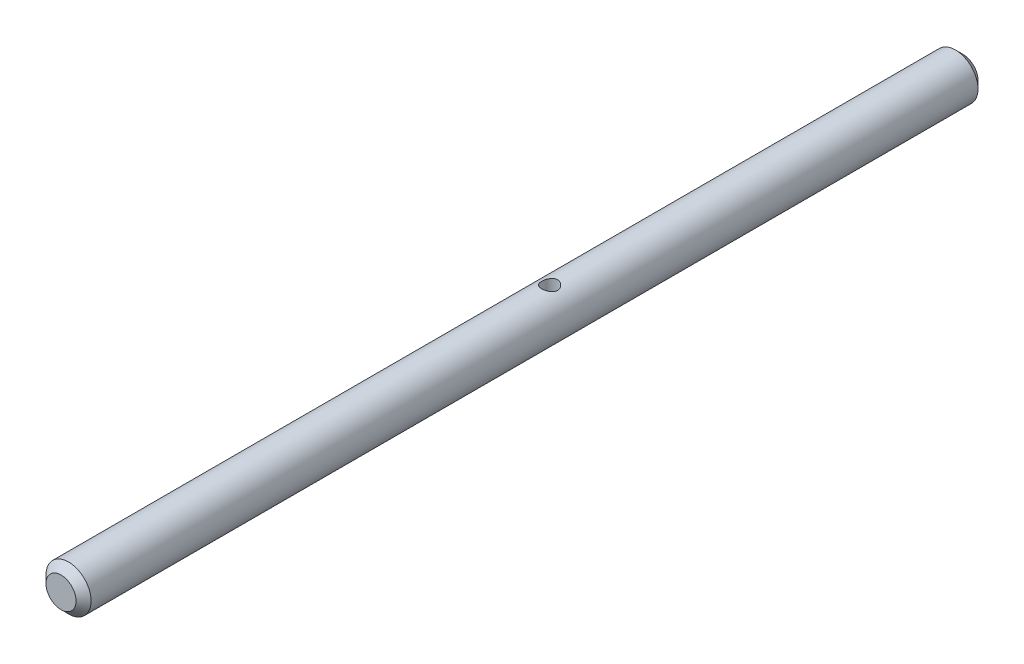
ISO-10303-21;
HEADER;
FILE_DESCRIPTION(('STEP AP214'),'2;1');
FILE_NAME('part.step','',(''),(''),'','','');
FILE_SCHEMA(('AUTOMOTIVE_DESIGN { 1 0 10303 214 1 1 1 1 }'));
ENDSEC;
DATA;
#1=APPLICATION_CONTEXT('core data for automotive mechanical design processes');
#2=APPLICATION_PROTOCOL_DEFINITION('international standard','automotive_design',2000,#1);
#3=PRODUCT_CONTEXT('',#1,'mechanical');
#4=PRODUCT('Part','Part','',(#3));
#5=PRODUCT_RELATED_PRODUCT_CATEGORY('part','',(#4));
#6=PRODUCT_DEFINITION_FORMATION('','',#4);
#7=PRODUCT_DEFINITION_CONTEXT('part definition',#1,'design');
#8=PRODUCT_DEFINITION('design','',#6,#7);
#9=PRODUCT_DEFINITION_SHAPE('','',#8);
#10=(LENGTH_UNIT() NAMED_UNIT(*) SI_UNIT(.MILLI.,.METRE.));
#11=(NAMED_UNIT(*) PLANE_ANGLE_UNIT() SI_UNIT($,.RADIAN.));
#12=(NAMED_UNIT(*) SI_UNIT($,.STERADIAN.) SOLID_ANGLE_UNIT());
#13=UNCERTAINTY_MEASURE_WITH_UNIT(LENGTH_MEASURE(1.E-05),#10,'distance_accuracy_value','');
#14=(GEOMETRIC_REPRESENTATION_CONTEXT(3) GLOBAL_UNCERTAINTY_ASSIGNED_CONTEXT((#13)) GLOBAL_UNIT_ASSIGNED_CONTEXT((#10,
#11,#12)) REPRESENTATION_CONTEXT('',''));
#15=CARTESIAN_POINT('',(0.,0.,0.));
#16=DIRECTION('',(0.,0.,1.));
#17=DIRECTION('',(1.,0.,0.));
#18=AXIS2_PLACEMENT_3D('',#15,#16,#17);
#19=CARTESIAN_POINT('',(0.,0.,65.));
#20=DIRECTION('',(0.,0.,-1.));
#21=DIRECTION('',(-1.,0.,0.));
#22=AXIS2_PLACEMENT_3D('',#19,#20,#21);
#23=CYLINDRICAL_SURFACE('',#22,3.);
#24=CARTESIAN_POINT('',(0.,-3.,1.05));
#25=CARTESIAN_POINT('',(0.057125809700311,-3.00000062239861,1.05000088699482));
#26=CARTESIAN_POINT('',(0.114245286481722,-2.99835359336143,1.04532309857839));
#27=CARTESIAN_POINT('',(0.226792007750672,-2.99194636275058,1.02679986205134));
#28=CARTESIAN_POINT('',(0.28221924468481,-2.98718614728315,1.01295437302645));
#29=CARTESIAN_POINT('',(0.389742706804827,-2.9750673807671,0.97663531844941));
#30=CARTESIAN_POINT('',(0.441844648127425,-2.96771343859195,0.954177051068296));
#31=CARTESIAN_POINT('',(0.541540993588452,-2.95115069919435,0.901342466620792));
#32=CARTESIAN_POINT('',(0.589134369738941,-2.94194148044382,0.87096434966302));
#33=CARTESIAN_POINT('',(0.680257767615976,-2.92224185208095,0.801951445304782));
#34=CARTESIAN_POINT('',(0.723594589428122,-2.91171852533116,0.763071024533266));
#35=CARTESIAN_POINT('',(0.803283555453782,-2.89075018483192,0.678678999315781));
#36=CARTESIAN_POINT('',(0.839633942619032,-2.88030519141591,0.633165731793872));
#37=CARTESIAN_POINT('',(0.905468869308254,-2.86030606263984,0.5350036051324));
#38=CARTESIAN_POINT('',(0.934693899184863,-2.85079156836078,0.482171832462236));
#39=CARTESIAN_POINT('',(0.983759796853539,-2.83423573303673,0.371956622912636));
#40=CARTESIAN_POINT('',(1.00360386635585,-2.82719354840699,0.314574746797175));
#41=CARTESIAN_POINT('',(1.03260491798275,-2.81672830906348,0.199097090195499));
#42=CARTESIAN_POINT('',(1.04212670146365,-2.81318214821205,0.141104430859138));
#43=CARTESIAN_POINT('',(1.05135359332162,-2.80974771563063,0.0242444643240508));
#44=CARTESIAN_POINT('',(1.05106211296219,-2.80985817279553,-0.0346225318272274));
#45=CARTESIAN_POINT('',(1.04095229970208,-2.8136172805216,-0.148364837664779));
#46=CARTESIAN_POINT('',(1.03162114530745,-2.81708499131304,-0.203290494084245));
#47=CARTESIAN_POINT('',(1.004495724937,-2.82687001365272,-0.310740721887313));
#48=CARTESIAN_POINT('',(0.986700347341817,-2.83318769948691,-0.363264976897766));
#49=CARTESIAN_POINT('',(0.942853113277016,-2.84808183213407,-0.465483710033615));
#50=CARTESIAN_POINT('',(0.916663996339133,-2.85669539776699,-0.515113665404532));
#51=CARTESIAN_POINT('',(0.856868065509058,-2.875196438657,-0.609423584695463));
#52=CARTESIAN_POINT('',(0.823258938368083,-2.88508431078851,-0.654101998393184));
#53=CARTESIAN_POINT('',(0.747280198555877,-2.90571972393734,-0.73996296851083));
#54=CARTESIAN_POINT('',(0.704515823526199,-2.91648387973262,-0.780792974864614));
#55=CARTESIAN_POINT('',(0.61261705417668,-2.93716122241272,-0.854798961566729));
#56=CARTESIAN_POINT('',(0.563481918150992,-2.94707430998955,-0.887974049451181));
#57=CARTESIAN_POINT('',(0.459430418735545,-2.96508694009862,-0.946051797376233));
#58=CARTESIAN_POINT('',(0.404452141023122,-2.97316346398367,-0.970851168733544));
#59=CARTESIAN_POINT('',(0.290752542892286,-2.9864246470609,-1.01073669205995));
#60=CARTESIAN_POINT('',(0.232032671651071,-2.99161041839076,-1.02582657983148));
#61=CARTESIAN_POINT('',(0.115494613104425,-2.99831718048857,-1.04521974402653));
#62=CARTESIAN_POINT('',(0.057764789588101,-2.99999966749628,-1.04999874195568));
#63=CARTESIAN_POINT('',(-0.0576889459315287,-3.00000033208947,-1.05000125680263));
#64=CARTESIAN_POINT('',(-0.115412856994875,-2.99831914442556,-1.04522657657108));
#65=CARTESIAN_POINT('',(-0.227253688414071,-2.9918880969612,-1.0266283950289));
#66=CARTESIAN_POINT('',(-0.281426858219664,-2.98723989247293,-1.01310445867993));
#67=CARTESIAN_POINT('',(-0.386707513253059,-2.97544377032776,-0.977773855529838));
#68=CARTESIAN_POINT('',(-0.437814600809596,-2.9682955292334,-0.955966116996228));
#69=CARTESIAN_POINT('',(-0.537092038381799,-2.95197127586304,-0.904022973410559));
#70=CARTESIAN_POINT('',(-0.585141972382347,-2.94274462029458,-0.873673804588941));
#71=CARTESIAN_POINT('',(-0.675617336275093,-2.92330055240106,-0.805756446128059));
#72=CARTESIAN_POINT('',(-0.718040890717794,-2.91308281167123,-0.768185859532824));
#73=CARTESIAN_POINT('',(-0.798285946141175,-2.89215251917262,-0.684659939515782));
#74=CARTESIAN_POINT('',(-0.835768353485368,-2.88144094674374,-0.638377767606953));
#75=CARTESIAN_POINT('',(-0.902486227877181,-2.86124753607208,-0.53995623018005));
#76=CARTESIAN_POINT('',(-0.931721405572006,-2.85176574098217,-0.487816659245738));
#77=CARTESIAN_POINT('',(-0.981032944437743,-2.83518166484842,-0.378999812937753));
#78=CARTESIAN_POINT('',(-1.00110911919668,-2.82807943223629,-0.322322445234495));
#79=CARTESIAN_POINT('',(-1.03132549856235,-2.81720262619425,-0.206080363834097));
#80=CARTESIAN_POINT('',(-1.04147080141017,-2.81342634541054,-0.146517148154039));
#81=CARTESIAN_POINT('',(-1.05111581788712,-2.80983618310972,-0.0298139035373461));
#82=CARTESIAN_POINT('',(-1.05118419234222,-2.80981064040343,0.0272730890056116));
#83=CARTESIAN_POINT('',(-1.04209530006856,-2.81319398050238,0.14059878694728));
#84=CARTESIAN_POINT('',(-1.03293869618356,-2.81660261655106,0.196837552999058));
#85=CARTESIAN_POINT('',(-1.00607895941543,-2.82630508202671,0.305565287622852));
#86=CARTESIAN_POINT('',(-0.988578317166267,-2.83253038362614,0.358110890004141));
#87=CARTESIAN_POINT('',(-0.945696358735926,-2.84713346898649,0.459557428442074));
#88=CARTESIAN_POINT('',(-0.920313188031808,-2.85551175920106,0.508457503454465));
#89=CARTESIAN_POINT('',(-0.860991062095818,-2.87396962707343,0.60373037261769));
#90=CARTESIAN_POINT('',(-0.826704722171115,-2.88411085498004,0.64987482006044));
#91=CARTESIAN_POINT('',(-0.751117203402195,-2.90471268439993,0.735938288605056));
#92=CARTESIAN_POINT('',(-0.709813945932143,-2.91517337979392,0.775855458255606));
#93=CARTESIAN_POINT('',(-0.619155949511042,-2.93579600858154,0.850135134514215));
#94=CARTESIAN_POINT('',(-0.56952419358847,-2.94592378670913,0.884170335152833));
#95=CARTESIAN_POINT('',(-0.464900288724999,-2.96423407851471,0.943387048583875));
#96=CARTESIAN_POINT('',(-0.409908850958984,-2.97241684978103,0.968569733977116));
#97=CARTESIAN_POINT('',(-0.29670895131798,-2.98582884304949,1.00897716571235));
#98=CARTESIAN_POINT('',(-0.238541863875951,-2.99108914524198,1.02430698257103));
#99=CARTESIAN_POINT('',(-0.1202470474816,-2.99817379114812,1.04481614550155));
#100=CARTESIAN_POINT('',(-0.0601200166470329,-2.99999934497883,1.04999906651401));
#101=CARTESIAN_POINT('',(0.,-3.,1.05));
#102=B_SPLINE_CURVE_WITH_KNOTS('',3,(#24,#25,#26,#27,#28,#29,#30,#31,#32,#33,#34,#35,#36,#37,
#38,#39,#40,#41,#42,#43,#44,#45,#46,#47,#48,#49,#50,#51,#52,#53,#54,#55,#56,#57,#58,#59,#60,#61,
#62,#63,#64,#65,#66,#67,#68,#69,#70,#71,#72,#73,#74,#75,#76,#77,#78,#79,#80,#81,#82,#83,#84,#85,
#86,#87,#88,#89,#90,#91,#92,#93,#94,#95,#96,#97,#98,#99,#100,#101),.UNSPECIFIED.,.T.,.F.,(4,2,2,
2,2,2,2,2,2,2,2,2,2,2,2,2,2,2,2,2,2,2,2,2,2,2,2,2,2,2,2,2,2,2,2,2,2,2,4),(0.,0.171155983209425,
0.342312730270963,0.513166863264603,0.684059859036381,0.860763870308842,1.03751226364256,
1.2199661534413,1.40235772691336,1.57806910174892,1.75371939684406,1.9204014016052,
2.08710530301546,2.25668771399579,2.42632306852272,2.60578734413157,2.78527253237963,
2.96689654271971,3.1484506298981,3.3214312662906,3.49437926301959,3.66169841130955,
3.82903921420617,4.00101113312583,4.17304023239415,4.35372772689981,4.53442156001049,
4.71511907059486,4.89572376723631,5.06613244737584,5.23652888398794,5.40298574807538,
5.56948180418705,5.74383921266595,5.9182483614979,6.10043934121055,6.2826061788735,
6.46279667190451,6.64292366903193),.UNSPECIFIED.);
#103=CARTESIAN_POINT('',(0.,-3.,1.05));
#104=VERTEX_POINT('',#103);
#105=EDGE_CURVE('E10',#104,#104,#102,.T.);
#106=ORIENTED_EDGE('',*,*,#105,.T.);
#107=EDGE_LOOP('',(#106));
#108=FACE_BOUND('',#107,.T.);
#109=CARTESIAN_POINT('',(0.,3.,1.05));
#110=CARTESIAN_POINT('',(-0.0571258097003111,3.00000062239861,1.05000088699482));
#111=CARTESIAN_POINT('',(-0.114245286481722,2.99835359336143,1.04532309857839));
#112=CARTESIAN_POINT('',(-0.226792007750673,2.99194636275058,1.02679986205134));
#113=CARTESIAN_POINT('',(-0.28221924468481,2.98718614728315,1.01295437302645));
#114=CARTESIAN_POINT('',(-0.389742706804827,2.9750673807671,0.97663531844941));
#115=CARTESIAN_POINT('',(-0.441844648127426,2.96771343859195,0.954177051068295));
#116=CARTESIAN_POINT('',(-0.541540993588452,2.95115069919435,0.901342466620791));
#117=CARTESIAN_POINT('',(-0.589134369738941,2.94194148044382,0.870964349663019));
#118=CARTESIAN_POINT('',(-0.680257767615976,2.92224185208095,0.801951445304782));
#119=CARTESIAN_POINT('',(-0.723594589428122,2.91171852533116,0.763071024533266));
#120=CARTESIAN_POINT('',(-0.803283555453783,2.89075018483192,0.678678999315781));
#121=CARTESIAN_POINT('',(-0.839633942619033,2.88030519141591,0.633165731793872));
#122=CARTESIAN_POINT('',(-0.905468869308254,2.86030606263984,0.535003605132399));
#123=CARTESIAN_POINT('',(-0.934693899184863,2.85079156836078,0.482171832462235));
#124=CARTESIAN_POINT('',(-0.983759796853539,2.83423573303673,0.371956622912636));
#125=CARTESIAN_POINT('',(-1.00360386635585,2.82719354840699,0.314574746797175));
#126=CARTESIAN_POINT('',(-1.03260491798275,2.81672830906348,0.199097090195499));
#127=CARTESIAN_POINT('',(-1.04212670146365,2.81318214821205,0.141104430859137));
#128=CARTESIAN_POINT('',(-1.05135359332162,2.80974771563063,0.0242444643240503));
#129=CARTESIAN_POINT('',(-1.05106211296219,2.80985817279553,-0.0346225318272279));
#130=CARTESIAN_POINT('',(-1.04095229970208,2.8136172805216,-0.14836483766478));
#131=CARTESIAN_POINT('',(-1.03162114530745,2.81708499131304,-0.203290494084245));
#132=CARTESIAN_POINT('',(-1.004495724937,2.82687001365272,-0.310740721887314));
#133=CARTESIAN_POINT('',(-0.986700347341817,2.83318769948691,-0.363264976897766));
#134=CARTESIAN_POINT('',(-0.942853113277015,2.84808183213407,-0.465483710033616));
#135=CARTESIAN_POINT('',(-0.916663996339133,2.85669539776699,-0.515113665404532));
#136=CARTESIAN_POINT('',(-0.856868065509058,2.875196438657,-0.609423584695463));
#137=CARTESIAN_POINT('',(-0.823258938368083,2.88508431078851,-0.654101998393184));
#138=CARTESIAN_POINT('',(-0.747280198555877,2.90571972393734,-0.739962968510831));
#139=CARTESIAN_POINT('',(-0.704515823526199,2.91648387973262,-0.780792974864615));
#140=CARTESIAN_POINT('',(-0.612617054176679,2.93716122241272,-0.854798961566729));
#141=CARTESIAN_POINT('',(-0.563481918150992,2.94707430998955,-0.887974049451181));
#142=CARTESIAN_POINT('',(-0.459430418735545,2.96508694009862,-0.946051797376233));
#143=CARTESIAN_POINT('',(-0.404452141023121,2.97316346398367,-0.970851168733544));
#144=CARTESIAN_POINT('',(-0.290752542892285,2.9864246470609,-1.01073669205995));
#145=CARTESIAN_POINT('',(-0.232032671651071,2.99161041839076,-1.02582657983148));
#146=CARTESIAN_POINT('',(-0.115494613104425,2.99831718048857,-1.04521974402653));
#147=CARTESIAN_POINT('',(-0.0577647895881009,2.99999966749628,-1.04999874195568));
#148=CARTESIAN_POINT('',(0.0576889459315289,3.00000033208947,-1.05000125680263));
#149=CARTESIAN_POINT('',(0.115412856994875,2.99831914442556,-1.04522657657108));
#150=CARTESIAN_POINT('',(0.227253688414071,2.9918880969612,-1.0266283950289));
#151=CARTESIAN_POINT('',(0.281426858219664,2.98723989247293,-1.01310445867993));
#152=CARTESIAN_POINT('',(0.386707513253059,2.97544377032776,-0.977773855529838));
#153=CARTESIAN_POINT('',(0.437814600809597,2.9682955292334,-0.955966116996228));
#154=CARTESIAN_POINT('',(0.537092038381799,2.95197127586304,-0.904022973410559));
#155=CARTESIAN_POINT('',(0.585141972382348,2.94274462029458,-0.87367380458894));
#156=CARTESIAN_POINT('',(0.675617336275094,2.92330055240106,-0.805756446128058));
#157=CARTESIAN_POINT('',(0.718040890717795,2.91308281167123,-0.768185859532824));
#158=CARTESIAN_POINT('',(0.798285946141176,2.89215251917262,-0.684659939515781));
#159=CARTESIAN_POINT('',(0.835768353485368,2.88144094674374,-0.638377767606952));
#160=CARTESIAN_POINT('',(0.902486227877181,2.86124753607208,-0.539956230180049));
#161=CARTESIAN_POINT('',(0.931721405572006,2.85176574098217,-0.487816659245737));
#162=CARTESIAN_POINT('',(0.981032944437743,2.83518166484842,-0.378999812937752));
#163=CARTESIAN_POINT('',(1.00110911919668,2.82807943223629,-0.322322445234494));
#164=CARTESIAN_POINT('',(1.03132549856235,2.81720262619425,-0.206080363834097));
#165=CARTESIAN_POINT('',(1.04147080141017,2.81342634541054,-0.146517148154039));
#166=CARTESIAN_POINT('',(1.05111581788712,2.80983618310972,-0.0298139035373457));
#167=CARTESIAN_POINT('',(1.05118419234222,2.80981064040343,0.0272730890056118));
#168=CARTESIAN_POINT('',(1.04209530006856,2.81319398050238,0.140598786947281));
#169=CARTESIAN_POINT('',(1.03293869618356,2.81660261655106,0.196837552999058));
#170=CARTESIAN_POINT('',(1.00607895941543,2.82630508202671,0.305565287622852));
#171=CARTESIAN_POINT('',(0.988578317166267,2.83253038362614,0.358110890004141));
#172=CARTESIAN_POINT('',(0.945696358735926,2.84713346898649,0.459557428442074));
#173=CARTESIAN_POINT('',(0.920313188031808,2.85551175920106,0.508457503454465));
#174=CARTESIAN_POINT('',(0.860991062095817,2.87396962707343,0.60373037261769));
#175=CARTESIAN_POINT('',(0.826704722171115,2.88411085498004,0.64987482006044));
#176=CARTESIAN_POINT('',(0.751117203402195,2.90471268439993,0.735938288605057));
#177=CARTESIAN_POINT('',(0.709813945932143,2.91517337979392,0.775855458255606));
#178=CARTESIAN_POINT('',(0.619155949511042,2.93579600858154,0.850135134514215));
#179=CARTESIAN_POINT('',(0.56952419358847,2.94592378670913,0.884170335152833));
#180=CARTESIAN_POINT('',(0.464900288724998,2.96423407851471,0.943387048583875));
#181=CARTESIAN_POINT('',(0.409908850958984,2.97241684978103,0.968569733977116));
#182=CARTESIAN_POINT('',(0.29670895131798,2.98582884304949,1.00897716571235));
#183=CARTESIAN_POINT('',(0.238541863875951,2.99108914524198,1.02430698257103));
#184=CARTESIAN_POINT('',(0.1202470474816,2.99817379114812,1.04481614550155));
#185=CARTESIAN_POINT('',(0.060120016647033,2.99999934497883,1.04999906651401));
#186=CARTESIAN_POINT('',(0.,3.,1.05));
#187=B_SPLINE_CURVE_WITH_KNOTS('',3,(#109,#110,#111,#112,#113,#114,#115,#116,#117,#118,#119,
#120,#121,#122,#123,#124,#125,#126,#127,#128,#129,#130,#131,#132,#133,#134,#135,#136,#137,#138,
#139,#140,#141,#142,#143,#144,#145,#146,#147,#148,#149,#150,#151,#152,#153,#154,#155,#156,#157,
#158,#159,#160,#161,#162,#163,#164,#165,#166,#167,#168,#169,#170,#171,#172,#173,#174,#175,#176,
#177,#178,#179,#180,#181,#182,#183,#184,#185,#186),.UNSPECIFIED.,.T.,.F.,(4,2,2,2,2,2,2,2,2,2,2,
2,2,2,2,2,2,2,2,2,2,2,2,2,2,2,2,2,2,2,2,2,2,2,2,2,2,2,4),(0.,0.171155983209426,
0.342312730270963,0.513166863264603,0.684059859036381,0.860763870308842,1.03751226364256,
1.2199661534413,1.40235772691336,1.57806910174892,1.75371939684406,1.9204014016052,
2.08710530301546,2.25668771399579,2.42632306852272,2.60578734413157,2.78527253237963,
2.96689654271971,3.1484506298981,3.3214312662906,3.49437926301959,3.66169841130956,
3.82903921420618,4.00101113312583,4.17304023239415,4.35372772689981,4.53442156001049,
4.71511907059486,4.89572376723631,5.06613244737584,5.23652888398794,5.40298574807538,
5.56948180418705,5.74383921266594,5.9182483614979,6.10043934121055,6.2826061788735,
6.46279667190451,6.64292366903193),.UNSPECIFIED.);
#188=CARTESIAN_POINT('',(0.,3.,1.05));
#189=VERTEX_POINT('',#188);
#190=EDGE_CURVE('E47',#189,#189,#187,.T.);
#191=ORIENTED_EDGE('',*,*,#190,.T.);
#192=EDGE_LOOP('',(#191));
#193=FACE_BOUND('',#192,.T.);
#194=CARTESIAN_POINT('',(0.,0.,-54.));
#195=DIRECTION('',(0.,0.,1.));
#196=DIRECTION('',(1.,0.,0.));
#197=AXIS2_PLACEMENT_3D('',#194,#195,#196);
#198=CIRCLE('',#197,3.);
#199=CARTESIAN_POINT('',(3.,0.,-54.));
#200=VERTEX_POINT('',#199);
#201=EDGE_CURVE('E91',#200,#200,#198,.T.);
#202=ORIENTED_EDGE('',*,*,#201,.T.);
#203=EDGE_LOOP('',(#202));
#204=FACE_BOUND('',#203,.T.);
#205=CARTESIAN_POINT('',(0.,0.,64.));
#206=DIRECTION('',(0.,0.,1.));
#207=DIRECTION('',(1.,0.,0.));
#208=AXIS2_PLACEMENT_3D('',#205,#206,#207);
#209=CIRCLE('',#208,3.);
#210=CARTESIAN_POINT('',(3.,0.,64.));
#211=VERTEX_POINT('',#210);
#212=EDGE_CURVE('E89',#211,#211,#209,.F.);
#213=ORIENTED_EDGE('',*,*,#212,.T.);
#214=EDGE_LOOP('',(#213));
#215=FACE_BOUND('',#214,.T.);
#216=ADVANCED_FACE('F35',(#108,#193,#204,#215),#23,.T.);
#217=CARTESIAN_POINT('',(0.,0.,65.));
#218=DIRECTION('',(0.,0.,1.));
#219=DIRECTION('',(1.,0.,0.));
#220=AXIS2_PLACEMENT_3D('',#217,#218,#219);
#221=PLANE('',#220);
#222=CARTESIAN_POINT('',(0.,0.,65.));
#223=DIRECTION('',(0.,0.,1.));
#224=DIRECTION('',(1.,0.,0.));
#225=AXIS2_PLACEMENT_3D('',#222,#223,#224);
#226=CIRCLE('',#225,2.);
#227=CARTESIAN_POINT('',(2.,0.,65.));
#228=VERTEX_POINT('',#227);
#229=EDGE_CURVE('E52',#228,#228,#226,.T.);
#230=ORIENTED_EDGE('',*,*,#229,.T.);
#231=EDGE_LOOP('',(#230));
#232=FACE_BOUND('',#231,.T.);
#233=ADVANCED_FACE('F72',(#232),#221,.T.);
#234=CARTESIAN_POINT('',(0.,0.,-55.));
#235=DIRECTION('',(0.,0.,1.));
#236=DIRECTION('',(1.,0.,0.));
#237=AXIS2_PLACEMENT_3D('',#234,#235,#236);
#238=PLANE('',#237);
#239=CARTESIAN_POINT('',(0.,0.,-55.));
#240=DIRECTION('',(0.,0.,1.));
#241=DIRECTION('',(1.,0.,0.));
#242=AXIS2_PLACEMENT_3D('',#239,#240,#241);
#243=CIRCLE('',#242,1.99999999999997);
#244=CARTESIAN_POINT('',(1.99999999999997,0.,-55.));
#245=VERTEX_POINT('',#244);
#246=EDGE_CURVE('E56',#245,#245,#243,.F.);
#247=ORIENTED_EDGE('',*,*,#246,.T.);
#248=EDGE_LOOP('',(#247));
#249=FACE_BOUND('',#248,.T.);
#250=ADVANCED_FACE('F68',(#249),#238,.F.);
#251=CARTESIAN_POINT('',(0.,0.,-54.));
#252=DIRECTION('',(0.,0.,1.));
#253=DIRECTION('',(1.,0.,0.));
#254=AXIS2_PLACEMENT_3D('',#251,#252,#253);
#255=CONICAL_SURFACE('',#254,3.,0.785398163397461);
#256=ORIENTED_EDGE('',*,*,#246,.F.);
#257=EDGE_LOOP('',(#256));
#258=FACE_BOUND('',#257,.T.);
#259=ORIENTED_EDGE('',*,*,#201,.F.);
#260=EDGE_LOOP('',(#259));
#261=FACE_BOUND('',#260,.T.);
#262=ADVANCED_FACE('F71',(#258,#261),#255,.T.);
#263=CARTESIAN_POINT('',(0.,0.,65.));
#264=DIRECTION('',(0.,0.,-1.));
#265=DIRECTION('',(-1.,0.,0.));
#266=AXIS2_PLACEMENT_3D('',#263,#264,#265);
#267=CONICAL_SURFACE('',#266,2.,0.785398163397447);
#268=ORIENTED_EDGE('',*,*,#212,.F.);
#269=EDGE_LOOP('',(#268));
#270=FACE_BOUND('',#269,.T.);
#271=ORIENTED_EDGE('',*,*,#229,.F.);
#272=EDGE_LOOP('',(#271));
#273=FACE_BOUND('',#272,.T.);
#274=ADVANCED_FACE('F37',(#270,#273),#267,.T.);
#275=CARTESIAN_POINT('',(0.,-3.,0.));
#276=DIRECTION('',(0.,1.,0.));
#277=DIRECTION('',(0.,0.,1.));
#278=AXIS2_PLACEMENT_3D('',#275,#276,#277);
#279=CYLINDRICAL_SURFACE('',#278,1.05);
#280=ORIENTED_EDGE('',*,*,#190,.F.);
#281=EDGE_LOOP('',(#280));
#282=FACE_BOUND('',#281,.T.);
#283=ORIENTED_EDGE('',*,*,#105,.F.);
#284=EDGE_LOOP('',(#283));
#285=FACE_BOUND('',#284,.T.);
#286=ADVANCED_FACE('F63',(#282,#285),#279,.F.);
#287=CLOSED_SHELL('',(#216,#233,#250,#262,#274,#286));
#288=MANIFOLD_SOLID_BREP('B2',#287);
#289=ADVANCED_BREP_SHAPE_REPRESENTATION('',(#18,#288),#14);
#290=SHAPE_DEFINITION_REPRESENTATION(#9,#289);
ENDSEC;
END-ISO-10303-21;
